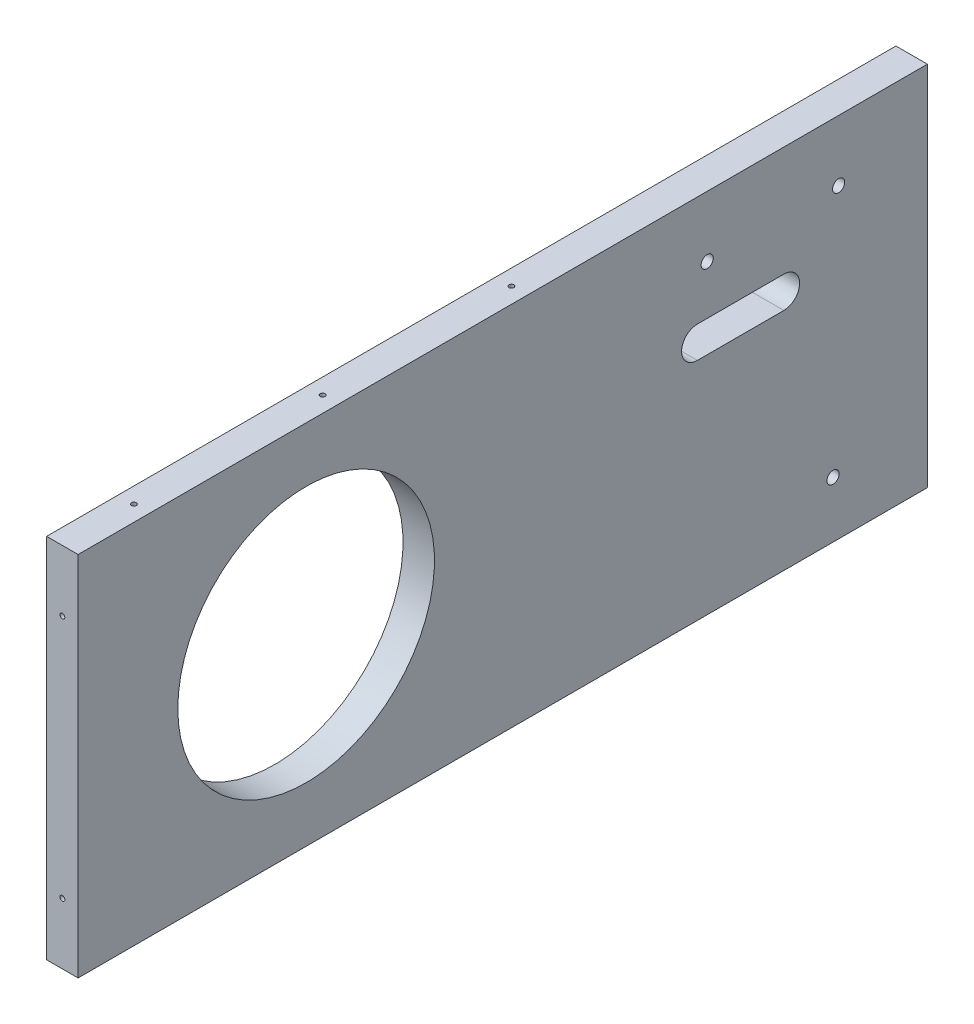
ISO-10303-21;
HEADER;
FILE_DESCRIPTION(('STEP AP214'),'2;1');
FILE_NAME('part.step','',(''),(''),'','','');
FILE_SCHEMA(('AUTOMOTIVE_DESIGN { 1 0 10303 214 1 1 1 1 }'));
ENDSEC;
DATA;
#1=APPLICATION_CONTEXT('core data for automotive mechanical design processes');
#2=APPLICATION_PROTOCOL_DEFINITION('international standard','automotive_design',2000,#1);
#3=PRODUCT_CONTEXT('',#1,'mechanical');
#4=PRODUCT('Part','Part','',(#3));
#5=PRODUCT_RELATED_PRODUCT_CATEGORY('part','',(#4));
#6=PRODUCT_DEFINITION_FORMATION('','',#4);
#7=PRODUCT_DEFINITION_CONTEXT('part definition',#1,'design');
#8=PRODUCT_DEFINITION('design','',#6,#7);
#9=PRODUCT_DEFINITION_SHAPE('','',#8);
#10=(LENGTH_UNIT() NAMED_UNIT(*) SI_UNIT(.MILLI.,.METRE.));
#11=(NAMED_UNIT(*) PLANE_ANGLE_UNIT() SI_UNIT($,.RADIAN.));
#12=(NAMED_UNIT(*) SI_UNIT($,.STERADIAN.) SOLID_ANGLE_UNIT());
#13=UNCERTAINTY_MEASURE_WITH_UNIT(LENGTH_MEASURE(1.E-05),#10,'distance_accuracy_value','');
#14=(GEOMETRIC_REPRESENTATION_CONTEXT(3) GLOBAL_UNCERTAINTY_ASSIGNED_CONTEXT((#13)) GLOBAL_UNIT_ASSIGNED_CONTEXT((#10,
#11,#12)) REPRESENTATION_CONTEXT('',''));
#15=CARTESIAN_POINT('',(0.,0.,0.));
#16=DIRECTION('',(0.,0.,1.));
#17=DIRECTION('',(1.,0.,0.));
#18=AXIS2_PLACEMENT_3D('',#15,#16,#17);
#19=CARTESIAN_POINT('',(-451.580249999978,-3.17499999999957,342.9));
#20=DIRECTION('',(1.,0.,0.));
#21=DIRECTION('',(0.,0.,-1.));
#22=AXIS2_PLACEMENT_3D('',#19,#20,#21);
#23=PLANE('',#22);
#24=DIRECTION('',(0.,0.,-1.));
#25=VECTOR('',#24,1.);
#26=CARTESIAN_POINT('',(-451.580249999978,-47.6224514026811,92.8625000000571));
#27=LINE('',#26,#25);
#28=CARTESIAN_POINT('',(-451.580249999978,-47.6224514026811,92.8625000000571));
#29=VERTEX_POINT('',#28);
#30=CARTESIAN_POINT('',(-451.580249999978,-47.6224514026811,57.9375000000571));
#31=VERTEX_POINT('',#30);
#32=EDGE_CURVE('E147',#29,#31,#27,.T.);
#33=ORIENTED_EDGE('',*,*,#32,.F.);
#34=CARTESIAN_POINT('',(-451.580249999978,-53.9724514026811,92.8625000000571));
#35=DIRECTION('',(-1.,0.,0.));
#36=DIRECTION('',(0.,0.,1.));
#37=AXIS2_PLACEMENT_3D('',#34,#35,#36);
#38=CIRCLE('',#37,6.35000000000001);
#39=CARTESIAN_POINT('',(-451.580249999978,-60.3224514026811,92.8625000000571));
#40=VERTEX_POINT('',#39);
#41=EDGE_CURVE('E52',#40,#29,#38,.T.);
#42=ORIENTED_EDGE('',*,*,#41,.F.);
#43=DIRECTION('',(0.,0.,1.));
#44=VECTOR('',#43,1.);
#45=CARTESIAN_POINT('',(-451.580249999978,-60.3224514026811,92.8625000000571));
#46=LINE('',#45,#44);
#47=CARTESIAN_POINT('',(-451.580249999978,-60.3224514026811,57.9375000000571));
#48=VERTEX_POINT('',#47);
#49=EDGE_CURVE('E134',#48,#40,#46,.T.);
#50=ORIENTED_EDGE('',*,*,#49,.F.);
#51=CARTESIAN_POINT('',(-451.580249999978,-53.9724514026811,57.9375000000571));
#52=DIRECTION('',(-1.,0.,0.));
#53=DIRECTION('',(0.,0.,1.));
#54=AXIS2_PLACEMENT_3D('',#51,#52,#53);
#55=CIRCLE('',#54,6.35);
#56=EDGE_CURVE('E153',#31,#48,#55,.T.);
#57=ORIENTED_EDGE('',*,*,#56,.F.);
#58=EDGE_LOOP('',(#33,#42,#50,#57));
#59=FACE_BOUND('',#58,.T.);
#60=CARTESIAN_POINT('',(-451.580249999978,-77.2147257014385,250.825000000036));
#61=DIRECTION('',(-1.,0.,0.));
#62=DIRECTION('',(0.,0.,1.));
#63=AXIS2_PLACEMENT_3D('',#60,#61,#62);
#64=CIRCLE('',#63,51.8147257013999);
#65=CARTESIAN_POINT('',(-451.580249999978,-77.2147257014385,302.639725701436));
#66=VERTEX_POINT('',#65);
#67=EDGE_CURVE('E140',#66,#66,#64,.T.);
#68=ORIENTED_EDGE('',*,*,#67,.F.);
#69=EDGE_LOOP('',(#68));
#70=FACE_BOUND('',#69,.T.);
#71=CARTESIAN_POINT('',(-451.580249999978,-27.7495000000026,35.827500000084));
#72=DIRECTION('',(-1.,0.,0.));
#73=DIRECTION('',(0.,0.,1.));
#74=AXIS2_PLACEMENT_3D('',#71,#72,#73);
#75=CIRCLE('',#74,2.45744999999999);
#76=CARTESIAN_POINT('',(-451.580249999978,-27.7495000000026,38.284950000084));
#77=VERTEX_POINT('',#76);
#78=EDGE_CURVE('E173',#77,#77,#75,.T.);
#79=ORIENTED_EDGE('',*,*,#78,.F.);
#80=EDGE_LOOP('',(#79));
#81=FACE_BOUND('',#80,.T.);
#82=CARTESIAN_POINT('',(-451.580249999978,-128.587499999989,38.1000000000827));
#83=DIRECTION('',(-1.,0.,0.));
#84=DIRECTION('',(0.,0.,1.));
#85=AXIS2_PLACEMENT_3D('',#82,#83,#84);
#86=CIRCLE('',#85,2.45745);
#87=CARTESIAN_POINT('',(-451.580249999978,-128.587499999989,40.5574500000827));
#88=VERTEX_POINT('',#87);
#89=EDGE_CURVE('E179',#88,#88,#86,.T.);
#90=ORIENTED_EDGE('',*,*,#89,.F.);
#91=EDGE_LOOP('',(#90));
#92=FACE_BOUND('',#91,.T.);
#93=DIRECTION('',(0.,-1.,0.));
#94=VECTOR('',#93,1.);
#95=CARTESIAN_POINT('',(-451.580249999978,-3.17499999999957,0.));
#96=LINE('',#95,#94);
#97=CARTESIAN_POINT('',(-451.580249999978,-3.17499999999957,0.));
#98=VERTEX_POINT('',#97);
#99=CARTESIAN_POINT('',(-451.580249999978,-151.254451402767,0.));
#100=VERTEX_POINT('',#99);
#101=EDGE_CURVE('E231',#98,#100,#96,.T.);
#102=ORIENTED_EDGE('',*,*,#101,.T.);
#103=DIRECTION('',(0.,0.,-1.));
#104=VECTOR('',#103,1.);
#105=CARTESIAN_POINT('',(-451.580249999978,-151.254451402767,342.9));
#106=LINE('',#105,#104);
#107=CARTESIAN_POINT('',(-451.580249999978,-151.254451402767,342.9));
#108=VERTEX_POINT('',#107);
#109=EDGE_CURVE('E236',#108,#100,#106,.T.);
#110=ORIENTED_EDGE('',*,*,#109,.F.);
#111=DIRECTION('',(0.,-1.,0.));
#112=VECTOR('',#111,1.);
#113=CARTESIAN_POINT('',(-451.580249999978,-3.17499999999957,342.9));
#114=LINE('',#113,#112);
#115=CARTESIAN_POINT('',(-451.580249999978,-3.17499999999957,342.9));
#116=VERTEX_POINT('',#115);
#117=EDGE_CURVE('E220',#116,#108,#114,.T.);
#118=ORIENTED_EDGE('',*,*,#117,.F.);
#119=DIRECTION('',(0.,0.,-1.));
#120=VECTOR('',#119,1.);
#121=CARTESIAN_POINT('',(-451.580249999978,-3.17499999999957,342.9));
#122=LINE('',#121,#120);
#123=EDGE_CURVE('E44',#116,#98,#122,.T.);
#124=ORIENTED_EDGE('',*,*,#123,.T.);
#125=EDGE_LOOP('',(#102,#110,#118,#124));
#126=FACE_BOUND('',#125,.T.);
#127=CARTESIAN_POINT('',(-451.580249999978,-27.7495000000026,88.9000000000836));
#128=DIRECTION('',(-1.,0.,0.));
#129=DIRECTION('',(0.,0.,1.));
#130=AXIS2_PLACEMENT_3D('',#127,#128,#129);
#131=CIRCLE('',#130,2.45744999999999);
#132=CARTESIAN_POINT('',(-451.580249999978,-27.7495000000026,91.3574500000836));
#133=VERTEX_POINT('',#132);
#134=EDGE_CURVE('E167',#133,#133,#131,.T.);
#135=ORIENTED_EDGE('',*,*,#134,.F.);
#136=EDGE_LOOP('',(#135));
#137=FACE_BOUND('',#136,.T.);
#138=ADVANCED_FACE('F35',(#59,#70,#81,#92,#126,#137),#23,.F.);
#139=CARTESIAN_POINT('',(-438.880249999978,-3.17499999999956,342.9));
#140=DIRECTION('',(-1.,0.,0.));
#141=DIRECTION('',(0.,0.,1.));
#142=AXIS2_PLACEMENT_3D('',#139,#140,#141);
#143=PLANE('',#142);
#144=DIRECTION('',(0.,0.,-1.));
#145=VECTOR('',#144,1.);
#146=CARTESIAN_POINT('',(-438.880249999978,-60.3224514026811,92.8625000000571));
#147=LINE('',#146,#145);
#148=CARTESIAN_POINT('',(-438.880249999978,-60.3224514026811,92.8625000000571));
#149=VERTEX_POINT('',#148);
#150=CARTESIAN_POINT('',(-438.880249999978,-60.3224514026811,57.9375000000571));
#151=VERTEX_POINT('',#150);
#152=EDGE_CURVE('E145',#149,#151,#147,.T.);
#153=ORIENTED_EDGE('',*,*,#152,.F.);
#154=CARTESIAN_POINT('',(-438.880249999978,-53.9724514026811,92.8625000000571));
#155=DIRECTION('',(-1.,0.,0.));
#156=DIRECTION('',(0.,0.,1.));
#157=AXIS2_PLACEMENT_3D('',#154,#155,#156);
#158=CIRCLE('',#157,6.35000000000001);
#159=CARTESIAN_POINT('',(-438.880249999978,-47.6224514026811,92.8625000000571));
#160=VERTEX_POINT('',#159);
#161=EDGE_CURVE('E128',#160,#149,#158,.F.);
#162=ORIENTED_EDGE('',*,*,#161,.F.);
#163=DIRECTION('',(0.,0.,1.));
#164=VECTOR('',#163,1.);
#165=CARTESIAN_POINT('',(-438.880249999978,-47.6224514026811,92.8625000000571));
#166=LINE('',#165,#164);
#167=CARTESIAN_POINT('',(-438.880249999978,-47.6224514026811,57.937500000057));
#168=VERTEX_POINT('',#167);
#169=EDGE_CURVE('E137',#168,#160,#166,.T.);
#170=ORIENTED_EDGE('',*,*,#169,.F.);
#171=CARTESIAN_POINT('',(-438.880249999978,-53.9724514026811,57.9375000000571));
#172=DIRECTION('',(-1.,0.,0.));
#173=DIRECTION('',(0.,0.,1.));
#174=AXIS2_PLACEMENT_3D('',#171,#172,#173);
#175=CIRCLE('',#174,6.35);
#176=EDGE_CURVE('E60',#151,#168,#175,.F.);
#177=ORIENTED_EDGE('',*,*,#176,.F.);
#178=EDGE_LOOP('',(#153,#162,#170,#177));
#179=FACE_BOUND('',#178,.T.);
#180=CARTESIAN_POINT('',(-438.880249999978,-77.2147257014385,250.825000000036));
#181=DIRECTION('',(-1.,0.,0.));
#182=DIRECTION('',(0.,0.,1.));
#183=AXIS2_PLACEMENT_3D('',#180,#181,#182);
#184=CIRCLE('',#183,51.8147257013999);
#185=CARTESIAN_POINT('',(-438.880249999978,-77.2147257014385,302.639725701436));
#186=VERTEX_POINT('',#185);
#187=EDGE_CURVE('E164',#186,#186,#184,.F.);
#188=ORIENTED_EDGE('',*,*,#187,.F.);
#189=EDGE_LOOP('',(#188));
#190=FACE_BOUND('',#189,.T.);
#191=CARTESIAN_POINT('',(-438.880249999978,-27.7495000000026,88.9000000000836));
#192=DIRECTION('',(-1.,0.,0.));
#193=DIRECTION('',(0.,0.,1.));
#194=AXIS2_PLACEMENT_3D('',#191,#192,#193);
#195=CIRCLE('',#194,2.45744999999999);
#196=CARTESIAN_POINT('',(-438.880249999978,-27.7495000000026,91.3574500000836));
#197=VERTEX_POINT('',#196);
#198=EDGE_CURVE('E170',#197,#197,#195,.T.);
#199=ORIENTED_EDGE('',*,*,#198,.T.);
#200=EDGE_LOOP('',(#199));
#201=FACE_BOUND('',#200,.T.);
#202=CARTESIAN_POINT('',(-438.880249999978,-27.7495000000026,35.827500000084));
#203=DIRECTION('',(-1.,0.,0.));
#204=DIRECTION('',(0.,0.,1.));
#205=AXIS2_PLACEMENT_3D('',#202,#203,#204);
#206=CIRCLE('',#205,2.45744999999999);
#207=CARTESIAN_POINT('',(-438.880249999978,-27.7495000000026,38.284950000084));
#208=VERTEX_POINT('',#207);
#209=EDGE_CURVE('E176',#208,#208,#206,.T.);
#210=ORIENTED_EDGE('',*,*,#209,.T.);
#211=EDGE_LOOP('',(#210));
#212=FACE_BOUND('',#211,.T.);
#213=CARTESIAN_POINT('',(-438.880249999978,-128.587499999989,38.1000000000827));
#214=DIRECTION('',(-1.,0.,0.));
#215=DIRECTION('',(0.,0.,1.));
#216=AXIS2_PLACEMENT_3D('',#213,#214,#215);
#217=CIRCLE('',#216,2.45745);
#218=CARTESIAN_POINT('',(-438.880249999978,-128.587499999989,40.5574500000827));
#219=VERTEX_POINT('',#218);
#220=EDGE_CURVE('E182',#219,#219,#217,.T.);
#221=ORIENTED_EDGE('',*,*,#220,.T.);
#222=EDGE_LOOP('',(#221));
#223=FACE_BOUND('',#222,.T.);
#224=DIRECTION('',(0.,1.,0.));
#225=VECTOR('',#224,1.);
#226=CARTESIAN_POINT('',(-438.880249999978,-3.17499999999956,0.));
#227=LINE('',#226,#225);
#228=CARTESIAN_POINT('',(-438.880249999978,-151.254451402767,0.));
#229=VERTEX_POINT('',#228);
#230=CARTESIAN_POINT('',(-438.880249999978,-3.17499999999956,0.));
#231=VERTEX_POINT('',#230);
#232=EDGE_CURVE('E225',#229,#231,#227,.T.);
#233=ORIENTED_EDGE('',*,*,#232,.T.);
#234=DIRECTION('',(0.,0.,-1.));
#235=VECTOR('',#234,1.);
#236=CARTESIAN_POINT('',(-438.880249999978,-3.17499999999956,342.9));
#237=LINE('',#236,#235);
#238=CARTESIAN_POINT('',(-438.880249999978,-3.17499999999956,342.9));
#239=VERTEX_POINT('',#238);
#240=EDGE_CURVE('E11',#239,#231,#237,.T.);
#241=ORIENTED_EDGE('',*,*,#240,.F.);
#242=DIRECTION('',(0.,1.,0.));
#243=VECTOR('',#242,1.);
#244=CARTESIAN_POINT('',(-438.880249999978,-3.17499999999956,342.9));
#245=LINE('',#244,#243);
#246=CARTESIAN_POINT('',(-438.880249999978,-151.254451402767,342.9));
#247=VERTEX_POINT('',#246);
#248=EDGE_CURVE('E214',#247,#239,#245,.T.);
#249=ORIENTED_EDGE('',*,*,#248,.F.);
#250=DIRECTION('',(0.,0.,-1.));
#251=VECTOR('',#250,1.);
#252=CARTESIAN_POINT('',(-438.880249999978,-151.254451402767,342.9));
#253=LINE('',#252,#251);
#254=EDGE_CURVE('E224',#247,#229,#253,.T.);
#255=ORIENTED_EDGE('',*,*,#254,.T.);
#256=EDGE_LOOP('',(#233,#241,#249,#255));
#257=FACE_BOUND('',#256,.T.);
#258=ADVANCED_FACE('F37',(#179,#190,#201,#212,#223,#257),#143,.F.);
#259=CARTESIAN_POINT('',(-438.880249999978,-3.17499999999956,342.9));
#260=DIRECTION('',(0.,-1.,0.));
#261=DIRECTION('',(1.,0.,0.));
#262=AXIS2_PLACEMENT_3D('',#259,#260,#261);
#263=PLANE('',#262);
#264=CARTESIAN_POINT('',(-445.230249999978,-3.17499999999956,314.007500000034));
#265=DIRECTION('',(0.,-1.,0.));
#266=DIRECTION('',(1.,0.,0.));
#267=AXIS2_PLACEMENT_3D('',#264,#265,#266);
#268=CIRCLE('',#267,0.992251);
#269=CARTESIAN_POINT('',(-444.237998999978,-3.17499999999956,314.007500000034));
#270=VERTEX_POINT('',#269);
#271=EDGE_CURVE('E195',#270,#270,#268,.T.);
#272=ORIENTED_EDGE('',*,*,#271,.T.);
#273=EDGE_LOOP('',(#272));
#274=FACE_BOUND('',#273,.T.);
#275=CARTESIAN_POINT('',(-445.230249999978,-3.17499999999956,237.807500000034));
#276=DIRECTION('',(0.,-1.,0.));
#277=DIRECTION('',(1.,0.,0.));
#278=AXIS2_PLACEMENT_3D('',#275,#276,#277);
#279=CIRCLE('',#278,0.992251);
#280=CARTESIAN_POINT('',(-444.237998999978,-3.17499999999956,237.807500000034));
#281=VERTEX_POINT('',#280);
#282=EDGE_CURVE('E199',#281,#281,#279,.T.);
#283=ORIENTED_EDGE('',*,*,#282,.T.);
#284=EDGE_LOOP('',(#283));
#285=FACE_BOUND('',#284,.T.);
#286=CARTESIAN_POINT('',(-445.230249999979,-3.17499999999956,161.607500000034));
#287=DIRECTION('',(0.,-1.,0.));
#288=DIRECTION('',(1.,0.,0.));
#289=AXIS2_PLACEMENT_3D('',#286,#287,#288);
#290=CIRCLE('',#289,0.992251);
#291=CARTESIAN_POINT('',(-444.237998999979,-3.17499999999956,161.607500000034));
#292=VERTEX_POINT('',#291);
#293=EDGE_CURVE('E203',#292,#292,#290,.T.);
#294=ORIENTED_EDGE('',*,*,#293,.T.);
#295=EDGE_LOOP('',(#294));
#296=FACE_BOUND('',#295,.T.);
#297=DIRECTION('',(-1.,0.,0.));
#298=VECTOR('',#297,1.);
#299=CARTESIAN_POINT('',(-438.880249999978,-3.17499999999956,0.));
#300=LINE('',#299,#298);
#301=EDGE_CURVE('E228',#231,#98,#300,.T.);
#302=ORIENTED_EDGE('',*,*,#301,.T.);
#303=ORIENTED_EDGE('',*,*,#123,.F.);
#304=DIRECTION('',(-1.,0.,0.));
#305=VECTOR('',#304,1.);
#306=CARTESIAN_POINT('',(-438.880249999978,-3.17499999999956,342.9));
#307=LINE('',#306,#305);
#308=EDGE_CURVE('E217',#239,#116,#307,.T.);
#309=ORIENTED_EDGE('',*,*,#308,.F.);
#310=ORIENTED_EDGE('',*,*,#240,.T.);
#311=EDGE_LOOP('',(#302,#303,#309,#310));
#312=FACE_BOUND('',#311,.T.);
#313=ADVANCED_FACE('F283',(#274,#285,#296,#312),#263,.F.);
#314=CARTESIAN_POINT('',(-438.880249999978,-151.254451402767,342.9));
#315=DIRECTION('',(0.,1.,0.));
#316=DIRECTION('',(0.,0.,1.));
#317=AXIS2_PLACEMENT_3D('',#314,#315,#316);
#318=PLANE('',#317);
#319=DIRECTION('',(1.,0.,0.));
#320=VECTOR('',#319,1.);
#321=CARTESIAN_POINT('',(-438.880249999978,-151.254451402767,0.));
#322=LINE('',#321,#320);
#323=EDGE_CURVE('E218',#100,#229,#322,.T.);
#324=ORIENTED_EDGE('',*,*,#323,.T.);
#325=ORIENTED_EDGE('',*,*,#254,.F.);
#326=DIRECTION('',(1.,0.,0.));
#327=VECTOR('',#326,1.);
#328=CARTESIAN_POINT('',(-438.880249999978,-151.254451402767,342.9));
#329=LINE('',#328,#327);
#330=EDGE_CURVE('E222',#108,#247,#329,.T.);
#331=ORIENTED_EDGE('',*,*,#330,.F.);
#332=ORIENTED_EDGE('',*,*,#109,.T.);
#333=EDGE_LOOP('',(#324,#325,#331,#332));
#334=FACE_BOUND('',#333,.T.);
#335=ADVANCED_FACE('F286',(#334),#318,.F.);
#336=CARTESIAN_POINT('',(0.,0.,342.9));
#337=DIRECTION('',(0.,0.,-1.));
#338=DIRECTION('',(-1.,0.,0.));
#339=AXIS2_PLACEMENT_3D('',#336,#337,#338);
#340=PLANE('',#339);
#341=CARTESIAN_POINT('',(-445.230249999978,-27.8549085672206,342.9));
#342=DIRECTION('',(0.,0.,-1.));
#343=DIRECTION('',(-1.,0.,0.));
#344=AXIS2_PLACEMENT_3D('',#341,#342,#343);
#345=CIRCLE('',#344,0.992251);
#346=CARTESIAN_POINT('',(-446.222500999978,-27.8549085672206,342.9));
#347=VERTEX_POINT('',#346);
#348=EDGE_CURVE('E39',#347,#347,#345,.T.);
#349=ORIENTED_EDGE('',*,*,#348,.T.);
#350=EDGE_LOOP('',(#349));
#351=FACE_BOUND('',#350,.T.);
#352=CARTESIAN_POINT('',(-445.230249999978,-126.574542835639,342.9));
#353=DIRECTION('',(0.,0.,-1.));
#354=DIRECTION('',(-1.,0.,0.));
#355=AXIS2_PLACEMENT_3D('',#352,#353,#354);
#356=CIRCLE('',#355,0.992251);
#357=CARTESIAN_POINT('',(-446.222500999978,-126.574542835639,342.9));
#358=VERTEX_POINT('',#357);
#359=EDGE_CURVE('E191',#358,#358,#356,.T.);
#360=ORIENTED_EDGE('',*,*,#359,.T.);
#361=EDGE_LOOP('',(#360));
#362=FACE_BOUND('',#361,.T.);
#363=ORIENTED_EDGE('',*,*,#248,.T.);
#364=ORIENTED_EDGE('',*,*,#308,.T.);
#365=ORIENTED_EDGE('',*,*,#117,.T.);
#366=ORIENTED_EDGE('',*,*,#330,.T.);
#367=EDGE_LOOP('',(#363,#364,#365,#366));
#368=FACE_BOUND('',#367,.T.);
#369=ADVANCED_FACE('F256',(#351,#362,#368),#340,.F.);
#370=CARTESIAN_POINT('',(0.,0.,0.));
#371=DIRECTION('',(0.,0.,-1.));
#372=DIRECTION('',(-1.,0.,0.));
#373=AXIS2_PLACEMENT_3D('',#370,#371,#372);
#374=PLANE('',#373);
#375=CARTESIAN_POINT('',(-445.230249999978,-40.1948628506921,0.));
#376=DIRECTION('',(0.,0.,-1.));
#377=DIRECTION('',(-1.,0.,0.));
#378=AXIS2_PLACEMENT_3D('',#375,#376,#377);
#379=CIRCLE('',#378,2.97662599999998);
#380=CARTESIAN_POINT('',(-448.206875999978,-40.1948628506921,0.));
#381=VERTEX_POINT('',#380);
#382=EDGE_CURVE('E213',#381,#381,#379,.T.);
#383=ORIENTED_EDGE('',*,*,#382,.F.);
#384=EDGE_LOOP('',(#383));
#385=FACE_BOUND('',#384,.T.);
#386=CARTESIAN_POINT('',(-445.230249999978,-77.214725701384,0.));
#387=DIRECTION('',(0.,0.,-1.));
#388=DIRECTION('',(-1.,0.,0.));
#389=AXIS2_PLACEMENT_3D('',#386,#387,#388);
#390=CIRCLE('',#389,2.97662599999998);
#391=CARTESIAN_POINT('',(-448.206875999978,-77.214725701384,0.));
#392=VERTEX_POINT('',#391);
#393=EDGE_CURVE('E243',#392,#392,#390,.T.);
#394=ORIENTED_EDGE('',*,*,#393,.F.);
#395=EDGE_LOOP('',(#394));
#396=FACE_BOUND('',#395,.T.);
#397=CARTESIAN_POINT('',(-445.230249999978,-114.234588552076,0.));
#398=DIRECTION('',(0.,0.,-1.));
#399=DIRECTION('',(-1.,0.,0.));
#400=AXIS2_PLACEMENT_3D('',#397,#398,#399);
#401=CIRCLE('',#400,2.97662599999998);
#402=CARTESIAN_POINT('',(-448.206875999978,-114.234588552076,0.));
#403=VERTEX_POINT('',#402);
#404=EDGE_CURVE('E229',#403,#403,#401,.T.);
#405=ORIENTED_EDGE('',*,*,#404,.F.);
#406=EDGE_LOOP('',(#405));
#407=FACE_BOUND('',#406,.T.);
#408=ORIENTED_EDGE('',*,*,#232,.F.);
#409=ORIENTED_EDGE('',*,*,#323,.F.);
#410=ORIENTED_EDGE('',*,*,#101,.F.);
#411=ORIENTED_EDGE('',*,*,#301,.F.);
#412=EDGE_LOOP('',(#408,#409,#410,#411));
#413=FACE_BOUND('',#412,.T.);
#414=ADVANCED_FACE('F310',(#385,#396,#407,#413),#374,.T.);
#415=CARTESIAN_POINT('',(-445.230249999978,-114.234588552076,-6.34999999992036));
#416=DIRECTION('',(0.,0.,-1.));
#417=DIRECTION('',(-1.,0.,0.));
#418=AXIS2_PLACEMENT_3D('',#415,#416,#417);
#419=CYLINDRICAL_SURFACE('',#418,2.97662599999998);
#420=ORIENTED_EDGE('',*,*,#404,.T.);
#421=EDGE_LOOP('',(#420));
#422=FACE_BOUND('',#421,.T.);
#423=CARTESIAN_POINT('',(-445.230249999978,-114.234588552076,12.6999999999988));
#424=DIRECTION('',(0.,0.,-1.));
#425=DIRECTION('',(-1.,0.,0.));
#426=AXIS2_PLACEMENT_3D('',#423,#424,#425);
#427=CIRCLE('',#426,2.97662599999998);
#428=CARTESIAN_POINT('',(-448.206875999978,-114.234588552076,12.6999999999988));
#429=VERTEX_POINT('',#428);
#430=EDGE_CURVE('E204',#429,#429,#427,.T.);
#431=ORIENTED_EDGE('',*,*,#430,.F.);
#432=EDGE_LOOP('',(#431));
#433=FACE_BOUND('',#432,.T.);
#434=ADVANCED_FACE('F321',(#422,#433),#419,.F.);
#435=CARTESIAN_POINT('',(-445.230249999978,-77.214725701384,-6.34999999992036));
#436=DIRECTION('',(0.,0.,-1.));
#437=DIRECTION('',(-1.,0.,0.));
#438=AXIS2_PLACEMENT_3D('',#435,#436,#437);
#439=CYLINDRICAL_SURFACE('',#438,2.97662599999998);
#440=ORIENTED_EDGE('',*,*,#393,.T.);
#441=EDGE_LOOP('',(#440));
#442=FACE_BOUND('',#441,.T.);
#443=CARTESIAN_POINT('',(-445.230249999978,-77.2147257013842,12.6999999999988));
#444=DIRECTION('',(0.,0.,-1.));
#445=DIRECTION('',(-1.,0.,0.));
#446=AXIS2_PLACEMENT_3D('',#443,#444,#445);
#447=CIRCLE('',#446,2.97662599999998);
#448=CARTESIAN_POINT('',(-448.206875999978,-77.2147257013842,12.6999999999988));
#449=VERTEX_POINT('',#448);
#450=EDGE_CURVE('E207',#449,#449,#447,.T.);
#451=ORIENTED_EDGE('',*,*,#450,.F.);
#452=EDGE_LOOP('',(#451));
#453=FACE_BOUND('',#452,.T.);
#454=ADVANCED_FACE('F327',(#442,#453),#439,.F.);
#455=CARTESIAN_POINT('',(-445.230249999978,-40.1948628506921,-6.34999999992036));
#456=DIRECTION('',(0.,0.,-1.));
#457=DIRECTION('',(-1.,0.,0.));
#458=AXIS2_PLACEMENT_3D('',#455,#456,#457);
#459=CYLINDRICAL_SURFACE('',#458,2.97662599999998);
#460=ORIENTED_EDGE('',*,*,#382,.T.);
#461=EDGE_LOOP('',(#460));
#462=FACE_BOUND('',#461,.T.);
#463=CARTESIAN_POINT('',(-445.230249999978,-40.1948628506923,12.6999999999988));
#464=DIRECTION('',(0.,0.,-1.));
#465=DIRECTION('',(-1.,0.,0.));
#466=AXIS2_PLACEMENT_3D('',#463,#464,#465);
#467=CIRCLE('',#466,2.97662599999998);
#468=CARTESIAN_POINT('',(-448.206875999978,-40.1948628506923,12.6999999999988));
#469=VERTEX_POINT('',#468);
#470=EDGE_CURVE('E210',#469,#469,#467,.T.);
#471=ORIENTED_EDGE('',*,*,#470,.F.);
#472=EDGE_LOOP('',(#471));
#473=FACE_BOUND('',#472,.T.);
#474=ADVANCED_FACE('F331',(#462,#473),#459,.F.);
#475=CARTESIAN_POINT('',(-445.230249999978,-40.1948628506923,12.6999999999988));
#476=DIRECTION('',(0.,0.,-1.));
#477=DIRECTION('',(-1.,0.,0.));
#478=AXIS2_PLACEMENT_3D('',#475,#476,#477);
#479=CONICAL_SURFACE('',#478,2.97662599999998,1.02974425867665);
#480=CARTESIAN_POINT('',(-445.230249999978,-40.1948628506923,14.4885373409723));
#481=VERTEX_POINT('',#480);
#482=VERTEX_LOOP('',#481);
#483=FACE_BOUND('',#482,.T.);
#484=ORIENTED_EDGE('',*,*,#470,.T.);
#485=EDGE_LOOP('',(#484));
#486=FACE_BOUND('',#485,.T.);
#487=ADVANCED_FACE('F335',(#483,#486),#479,.F.);
#488=CARTESIAN_POINT('',(-445.230249999978,-77.2147257013842,12.6999999999988));
#489=DIRECTION('',(0.,0.,-1.));
#490=DIRECTION('',(-1.,0.,0.));
#491=AXIS2_PLACEMENT_3D('',#488,#489,#490);
#492=CONICAL_SURFACE('',#491,2.97662599999998,1.02974425867665);
#493=CARTESIAN_POINT('',(-445.230249999978,-77.2147257013842,14.4885373409723));
#494=VERTEX_POINT('',#493);
#495=VERTEX_LOOP('',#494);
#496=FACE_BOUND('',#495,.T.);
#497=ORIENTED_EDGE('',*,*,#450,.T.);
#498=EDGE_LOOP('',(#497));
#499=FACE_BOUND('',#498,.T.);
#500=ADVANCED_FACE('F339',(#496,#499),#492,.F.);
#501=CARTESIAN_POINT('',(-445.230249999978,-114.234588552076,12.6999999999988));
#502=DIRECTION('',(0.,0.,-1.));
#503=DIRECTION('',(-1.,0.,0.));
#504=AXIS2_PLACEMENT_3D('',#501,#502,#503);
#505=CONICAL_SURFACE('',#504,2.97662599999998,1.02974425867665);
#506=CARTESIAN_POINT('',(-445.230249999978,-114.234588552076,14.4885373409723));
#507=VERTEX_POINT('',#506);
#508=VERTEX_LOOP('',#507);
#509=FACE_BOUND('',#508,.T.);
#510=ORIENTED_EDGE('',*,*,#430,.T.);
#511=EDGE_LOOP('',(#510));
#512=FACE_BOUND('',#511,.T.);
#513=ADVANCED_FACE('F343',(#509,#512),#505,.F.);
#514=CARTESIAN_POINT('',(-445.230249999979,15.8749999999778,161.607500000034));
#515=DIRECTION('',(0.,1.,0.));
#516=DIRECTION('',(0.,0.,1.));
#517=AXIS2_PLACEMENT_3D('',#514,#515,#516);
#518=CYLINDRICAL_SURFACE('',#517,0.992251);
#519=CARTESIAN_POINT('',(-445.230249999979,-22.2250000000221,161.607500000034));
#520=DIRECTION('',(0.,1.,0.));
#521=DIRECTION('',(0.,0.,1.));
#522=AXIS2_PLACEMENT_3D('',#519,#520,#521);
#523=CIRCLE('',#522,0.992251);
#524=CARTESIAN_POINT('',(-445.230249999979,-22.2250000000221,162.599751000034));
#525=VERTEX_POINT('',#524);
#526=EDGE_CURVE('E200',#525,#525,#523,.T.);
#527=ORIENTED_EDGE('',*,*,#526,.F.);
#528=EDGE_LOOP('',(#527));
#529=FACE_BOUND('',#528,.T.);
#530=ORIENTED_EDGE('',*,*,#293,.F.);
#531=EDGE_LOOP('',(#530));
#532=FACE_BOUND('',#531,.T.);
#533=ADVANCED_FACE('F347',(#529,#532),#518,.F.);
#534=CARTESIAN_POINT('',(-445.230249999979,-22.2250000000221,161.607500000034));
#535=DIRECTION('',(0.,1.,0.));
#536=DIRECTION('',(0.,0.,1.));
#537=AXIS2_PLACEMENT_3D('',#534,#535,#536);
#538=CONICAL_SURFACE('',#537,0.992251,1.02974425867665);
#539=CARTESIAN_POINT('',(-445.230249999979,-22.8212045501129,161.607500000034));
#540=VERTEX_POINT('',#539);
#541=VERTEX_LOOP('',#540);
#542=FACE_BOUND('',#541,.T.);
#543=ORIENTED_EDGE('',*,*,#526,.T.);
#544=EDGE_LOOP('',(#543));
#545=FACE_BOUND('',#544,.T.);
#546=ADVANCED_FACE('F349',(#542,#545),#538,.F.);
#547=CARTESIAN_POINT('',(-445.230249999978,15.8749999999778,237.807500000034));
#548=DIRECTION('',(0.,1.,0.));
#549=DIRECTION('',(0.,0.,1.));
#550=AXIS2_PLACEMENT_3D('',#547,#548,#549);
#551=CYLINDRICAL_SURFACE('',#550,0.992251);
#552=CARTESIAN_POINT('',(-445.230249999978,-22.2250000000222,237.807500000034));
#553=DIRECTION('',(0.,1.,0.));
#554=DIRECTION('',(0.,0.,1.));
#555=AXIS2_PLACEMENT_3D('',#552,#553,#554);
#556=CIRCLE('',#555,0.992251);
#557=CARTESIAN_POINT('',(-445.230249999978,-22.2250000000222,238.799751000034));
#558=VERTEX_POINT('',#557);
#559=EDGE_CURVE('E196',#558,#558,#556,.T.);
#560=ORIENTED_EDGE('',*,*,#559,.F.);
#561=EDGE_LOOP('',(#560));
#562=FACE_BOUND('',#561,.T.);
#563=ORIENTED_EDGE('',*,*,#282,.F.);
#564=EDGE_LOOP('',(#563));
#565=FACE_BOUND('',#564,.T.);
#566=ADVANCED_FACE('F352',(#562,#565),#551,.F.);
#567=CARTESIAN_POINT('',(-445.230249999978,-22.2250000000222,237.807500000034));
#568=DIRECTION('',(0.,1.,0.));
#569=DIRECTION('',(0.,0.,1.));
#570=AXIS2_PLACEMENT_3D('',#567,#568,#569);
#571=CONICAL_SURFACE('',#570,0.992251,1.02974425867665);
#572=CARTESIAN_POINT('',(-445.230249999978,-22.8212045501129,237.807500000034));
#573=VERTEX_POINT('',#572);
#574=VERTEX_LOOP('',#573);
#575=FACE_BOUND('',#574,.T.);
#576=ORIENTED_EDGE('',*,*,#559,.T.);
#577=EDGE_LOOP('',(#576));
#578=FACE_BOUND('',#577,.T.);
#579=ADVANCED_FACE('F357',(#575,#578),#571,.F.);
#580=CARTESIAN_POINT('',(-445.230249999978,15.8749999999778,314.007500000034));
#581=DIRECTION('',(0.,1.,0.));
#582=DIRECTION('',(0.,0.,1.));
#583=AXIS2_PLACEMENT_3D('',#580,#581,#582);
#584=CYLINDRICAL_SURFACE('',#583,0.992251);
#585=CARTESIAN_POINT('',(-445.230249999978,-22.2250000000222,314.007500000034));
#586=DIRECTION('',(0.,1.,0.));
#587=DIRECTION('',(0.,0.,1.));
#588=AXIS2_PLACEMENT_3D('',#585,#586,#587);
#589=CIRCLE('',#588,0.992251);
#590=CARTESIAN_POINT('',(-445.230249999978,-22.2250000000222,314.999751000034));
#591=VERTEX_POINT('',#590);
#592=EDGE_CURVE('E192',#591,#591,#589,.T.);
#593=ORIENTED_EDGE('',*,*,#592,.F.);
#594=EDGE_LOOP('',(#593));
#595=FACE_BOUND('',#594,.T.);
#596=ORIENTED_EDGE('',*,*,#271,.F.);
#597=EDGE_LOOP('',(#596));
#598=FACE_BOUND('',#597,.T.);
#599=ADVANCED_FACE('F272',(#595,#598),#584,.F.);
#600=CARTESIAN_POINT('',(-445.230249999978,-22.2250000000222,314.007500000034));
#601=DIRECTION('',(0.,1.,0.));
#602=DIRECTION('',(0.,0.,1.));
#603=AXIS2_PLACEMENT_3D('',#600,#601,#602);
#604=CONICAL_SURFACE('',#603,0.992251,1.02974425867665);
#605=CARTESIAN_POINT('',(-445.230249999978,-22.8212045501129,314.007500000034));
#606=VERTEX_POINT('',#605);
#607=VERTEX_LOOP('',#606);
#608=FACE_BOUND('',#607,.T.);
#609=ORIENTED_EDGE('',*,*,#592,.T.);
#610=EDGE_LOOP('',(#609));
#611=FACE_BOUND('',#610,.T.);
#612=ADVANCED_FACE('F262',(#608,#611),#604,.F.);
#613=CARTESIAN_POINT('',(-445.230249999978,-126.574542835639,361.949999999974));
#614=DIRECTION('',(0.,0.,1.));
#615=DIRECTION('',(1.,0.,0.));
#616=AXIS2_PLACEMENT_3D('',#613,#614,#615);
#617=CYLINDRICAL_SURFACE('',#616,0.992251);
#618=CARTESIAN_POINT('',(-445.230249999978,-126.574542835639,323.849999999974));
#619=DIRECTION('',(0.,0.,1.));
#620=DIRECTION('',(1.,0.,0.));
#621=AXIS2_PLACEMENT_3D('',#618,#619,#620);
#622=CIRCLE('',#621,0.992251);
#623=CARTESIAN_POINT('',(-444.237998999978,-126.574542835639,323.849999999974));
#624=VERTEX_POINT('',#623);
#625=EDGE_CURVE('E188',#624,#624,#622,.T.);
#626=ORIENTED_EDGE('',*,*,#625,.F.);
#627=EDGE_LOOP('',(#626));
#628=FACE_BOUND('',#627,.T.);
#629=ORIENTED_EDGE('',*,*,#359,.F.);
#630=EDGE_LOOP('',(#629));
#631=FACE_BOUND('',#630,.T.);
#632=ADVANCED_FACE('F259',(#628,#631),#617,.F.);
#633=CARTESIAN_POINT('',(-445.230249999978,-126.574542835639,323.849999999974));
#634=DIRECTION('',(0.,0.,1.));
#635=DIRECTION('',(1.,0.,0.));
#636=AXIS2_PLACEMENT_3D('',#633,#634,#635);
#637=CONICAL_SURFACE('',#636,0.992251,1.02974425867664);
#638=CARTESIAN_POINT('',(-445.230249999978,-126.574542835639,323.253795449883));
#639=VERTEX_POINT('',#638);
#640=VERTEX_LOOP('',#639);
#641=FACE_BOUND('',#640,.T.);
#642=ORIENTED_EDGE('',*,*,#625,.T.);
#643=EDGE_LOOP('',(#642));
#644=FACE_BOUND('',#643,.T.);
#645=ADVANCED_FACE('F261',(#641,#644),#637,.F.);
#646=CARTESIAN_POINT('',(-445.230249999978,-27.8549085672206,361.949999999974));
#647=DIRECTION('',(0.,0.,1.));
#648=DIRECTION('',(1.,0.,0.));
#649=AXIS2_PLACEMENT_3D('',#646,#647,#648);
#650=CYLINDRICAL_SURFACE('',#649,0.992251);
#651=CARTESIAN_POINT('',(-445.230249999978,-27.8549085672206,323.849999999974));
#652=DIRECTION('',(0.,0.,1.));
#653=DIRECTION('',(1.,0.,0.));
#654=AXIS2_PLACEMENT_3D('',#651,#652,#653);
#655=CIRCLE('',#654,0.992251);
#656=CARTESIAN_POINT('',(-444.237998999978,-27.8549085672206,323.849999999974));
#657=VERTEX_POINT('',#656);
#658=EDGE_CURVE('E185',#657,#657,#655,.T.);
#659=ORIENTED_EDGE('',*,*,#658,.F.);
#660=EDGE_LOOP('',(#659));
#661=FACE_BOUND('',#660,.T.);
#662=ORIENTED_EDGE('',*,*,#348,.F.);
#663=EDGE_LOOP('',(#662));
#664=FACE_BOUND('',#663,.T.);
#665=ADVANCED_FACE('F269',(#661,#664),#650,.F.);
#666=CARTESIAN_POINT('',(-445.230249999978,-27.8549085672206,323.849999999974));
#667=DIRECTION('',(0.,0.,1.));
#668=DIRECTION('',(1.,0.,0.));
#669=AXIS2_PLACEMENT_3D('',#666,#667,#668);
#670=CONICAL_SURFACE('',#669,0.992251,1.02974425867664);
#671=CARTESIAN_POINT('',(-445.230249999978,-27.8549085672206,323.253795449883));
#672=VERTEX_POINT('',#671);
#673=VERTEX_LOOP('',#672);
#674=FACE_BOUND('',#673,.T.);
#675=ORIENTED_EDGE('',*,*,#658,.T.);
#676=EDGE_LOOP('',(#675));
#677=FACE_BOUND('',#676,.T.);
#678=ADVANCED_FACE('F402',(#674,#677),#670,.F.);
#679=CARTESIAN_POINT('',(-451.580249999978,-128.587499999989,38.1000000000827));
#680=DIRECTION('',(-1.,0.,0.));
#681=DIRECTION('',(0.,0.,1.));
#682=AXIS2_PLACEMENT_3D('',#679,#680,#681);
#683=CYLINDRICAL_SURFACE('',#682,2.45745);
#684=ORIENTED_EDGE('',*,*,#220,.F.);
#685=EDGE_LOOP('',(#684));
#686=FACE_BOUND('',#685,.T.);
#687=ORIENTED_EDGE('',*,*,#89,.T.);
#688=EDGE_LOOP('',(#687));
#689=FACE_BOUND('',#688,.T.);
#690=ADVANCED_FACE('F412',(#686,#689),#683,.F.);
#691=CARTESIAN_POINT('',(-451.580249999978,-27.7495000000026,35.827500000084));
#692=DIRECTION('',(-1.,0.,0.));
#693=DIRECTION('',(0.,0.,1.));
#694=AXIS2_PLACEMENT_3D('',#691,#692,#693);
#695=CYLINDRICAL_SURFACE('',#694,2.45744999999999);
#696=ORIENTED_EDGE('',*,*,#209,.F.);
#697=EDGE_LOOP('',(#696));
#698=FACE_BOUND('',#697,.T.);
#699=ORIENTED_EDGE('',*,*,#78,.T.);
#700=EDGE_LOOP('',(#699));
#701=FACE_BOUND('',#700,.T.);
#702=ADVANCED_FACE('F422',(#698,#701),#695,.F.);
#703=CARTESIAN_POINT('',(-451.580249999978,-27.7495000000026,88.9000000000836));
#704=DIRECTION('',(-1.,0.,0.));
#705=DIRECTION('',(0.,0.,1.));
#706=AXIS2_PLACEMENT_3D('',#703,#704,#705);
#707=CYLINDRICAL_SURFACE('',#706,2.45744999999999);
#708=ORIENTED_EDGE('',*,*,#198,.F.);
#709=EDGE_LOOP('',(#708));
#710=FACE_BOUND('',#709,.T.);
#711=ORIENTED_EDGE('',*,*,#134,.T.);
#712=EDGE_LOOP('',(#711));
#713=FACE_BOUND('',#712,.T.);
#714=ADVANCED_FACE('F432',(#710,#713),#707,.F.);
#715=CARTESIAN_POINT('',(-438.879249999978,-77.2147257014385,250.825000000036));
#716=DIRECTION('',(-1.,0.,0.));
#717=DIRECTION('',(0.,0.,1.));
#718=AXIS2_PLACEMENT_3D('',#715,#716,#717);
#719=CYLINDRICAL_SURFACE('',#718,51.8147257013999);
#720=ORIENTED_EDGE('',*,*,#67,.T.);
#721=EDGE_LOOP('',(#720));
#722=FACE_BOUND('',#721,.T.);
#723=ORIENTED_EDGE('',*,*,#187,.T.);
#724=EDGE_LOOP('',(#723));
#725=FACE_BOUND('',#724,.T.);
#726=ADVANCED_FACE('F442',(#722,#725),#719,.F.);
#727=CARTESIAN_POINT('',(-438.879249999978,-53.9724514026811,92.8625000000571));
#728=DIRECTION('',(-1.,0.,0.));
#729=DIRECTION('',(0.,0.,1.));
#730=AXIS2_PLACEMENT_3D('',#727,#728,#729);
#731=CYLINDRICAL_SURFACE('',#730,6.35000000000001);
#732=ORIENTED_EDGE('',*,*,#161,.T.);
#733=DIRECTION('',(-1.,0.,0.));
#734=VECTOR('',#733,1.);
#735=CARTESIAN_POINT('',(-438.879249999978,-60.3224514026811,92.8625000000571));
#736=LINE('',#735,#734);
#737=EDGE_CURVE('E141',#149,#40,#736,.T.);
#738=ORIENTED_EDGE('',*,*,#737,.T.);
#739=ORIENTED_EDGE('',*,*,#41,.T.);
#740=DIRECTION('',(-1.,0.,0.));
#741=VECTOR('',#740,1.);
#742=CARTESIAN_POINT('',(-438.879249999978,-47.6224514026811,92.8625000000571));
#743=LINE('',#742,#741);
#744=EDGE_CURVE('E124',#160,#29,#743,.T.);
#745=ORIENTED_EDGE('',*,*,#744,.F.);
#746=EDGE_LOOP('',(#732,#738,#739,#745));
#747=FACE_BOUND('',#746,.T.);
#748=ADVANCED_FACE('F126',(#747),#731,.F.);
#749=CARTESIAN_POINT('',(-438.879249999978,-60.3224514026811,92.8625000000571));
#750=DIRECTION('',(0.,-1.,0.));
#751=DIRECTION('',(0.,0.,-1.));
#752=AXIS2_PLACEMENT_3D('',#749,#750,#751);
#753=PLANE('',#752);
#754=ORIENTED_EDGE('',*,*,#152,.T.);
#755=DIRECTION('',(-1.,0.,0.));
#756=VECTOR('',#755,1.);
#757=CARTESIAN_POINT('',(-438.879249999978,-60.3224514026811,57.9375000000571));
#758=LINE('',#757,#756);
#759=EDGE_CURVE('E159',#151,#48,#758,.T.);
#760=ORIENTED_EDGE('',*,*,#759,.T.);
#761=ORIENTED_EDGE('',*,*,#49,.T.);
#762=ORIENTED_EDGE('',*,*,#737,.F.);
#763=EDGE_LOOP('',(#754,#760,#761,#762));
#764=FACE_BOUND('',#763,.T.);
#765=ADVANCED_FACE('F471',(#764),#753,.F.);
#766=CARTESIAN_POINT('',(-438.879249999978,-53.9724514026811,57.9375000000571));
#767=DIRECTION('',(-1.,0.,0.));
#768=DIRECTION('',(0.,0.,1.));
#769=AXIS2_PLACEMENT_3D('',#766,#767,#768);
#770=CYLINDRICAL_SURFACE('',#769,6.35);
#771=ORIENTED_EDGE('',*,*,#176,.T.);
#772=DIRECTION('',(-1.,0.,0.));
#773=VECTOR('',#772,1.);
#774=CARTESIAN_POINT('',(-438.879249999978,-47.6224514026811,57.9375000000571));
#775=LINE('',#774,#773);
#776=EDGE_CURVE('E133',#168,#31,#775,.T.);
#777=ORIENTED_EDGE('',*,*,#776,.T.);
#778=ORIENTED_EDGE('',*,*,#56,.T.);
#779=ORIENTED_EDGE('',*,*,#759,.F.);
#780=EDGE_LOOP('',(#771,#777,#778,#779));
#781=FACE_BOUND('',#780,.T.);
#782=ADVANCED_FACE('F480',(#781),#770,.F.);
#783=CARTESIAN_POINT('',(-438.879249999978,-47.6224514026811,92.8625000000571));
#784=DIRECTION('',(0.,1.,0.));
#785=DIRECTION('',(0.,0.,1.));
#786=AXIS2_PLACEMENT_3D('',#783,#784,#785);
#787=PLANE('',#786);
#788=ORIENTED_EDGE('',*,*,#169,.T.);
#789=ORIENTED_EDGE('',*,*,#744,.T.);
#790=ORIENTED_EDGE('',*,*,#32,.T.);
#791=ORIENTED_EDGE('',*,*,#776,.F.);
#792=EDGE_LOOP('',(#788,#789,#790,#791));
#793=FACE_BOUND('',#792,.T.);
#794=ADVANCED_FACE('F138',(#793),#787,.F.);
#795=CLOSED_SHELL('',(#138,#258,#313,#335,#369,#414,#434,#454,#474,#487,#500,#513,#533,#546,
#566,#579,#599,#612,#632,#645,#665,#678,#690,#702,#714,#726,#748,#765,#782,#794));
#796=MANIFOLD_SOLID_BREP('B2',#795);
#797=ADVANCED_BREP_SHAPE_REPRESENTATION('',(#18,#796),#14);
#798=SHAPE_DEFINITION_REPRESENTATION(#9,#797);
ENDSEC;
END-ISO-10303-21;
